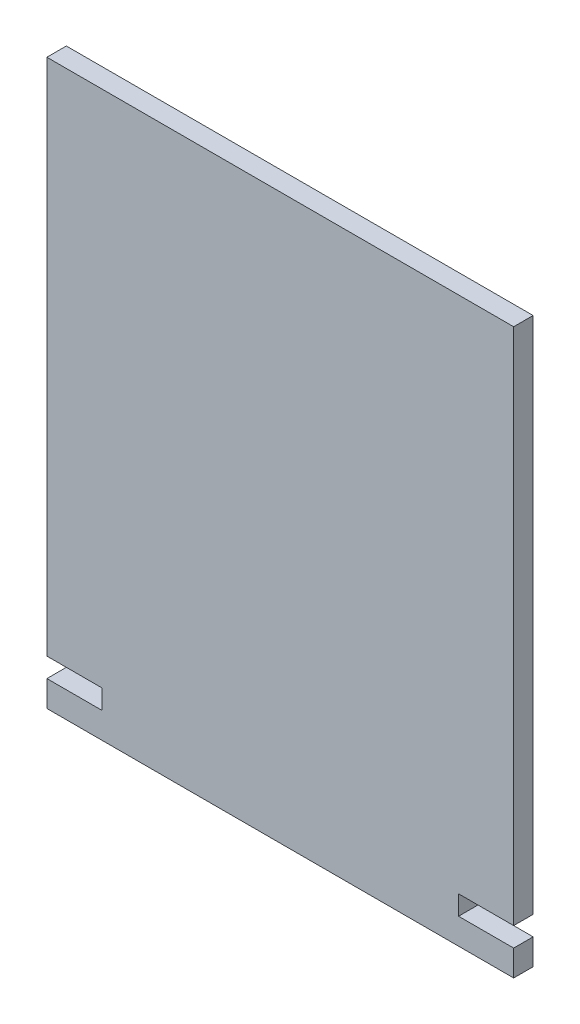
ISO-10303-21;
HEADER;
FILE_DESCRIPTION(('STEP AP214'),'2;1');
FILE_NAME('part.step','',(''),(''),'','','');
FILE_SCHEMA(('AUTOMOTIVE_DESIGN { 1 0 10303 214 1 1 1 1 }'));
ENDSEC;
DATA;
#1=APPLICATION_CONTEXT('core data for automotive mechanical design processes');
#2=APPLICATION_PROTOCOL_DEFINITION('international standard','automotive_design',2000,#1);
#3=PRODUCT_CONTEXT('',#1,'mechanical');
#4=PRODUCT('Part','Part','',(#3));
#5=PRODUCT_RELATED_PRODUCT_CATEGORY('part','',(#4));
#6=PRODUCT_DEFINITION_FORMATION('','',#4);
#7=PRODUCT_DEFINITION_CONTEXT('part definition',#1,'design');
#8=PRODUCT_DEFINITION('design','',#6,#7);
#9=PRODUCT_DEFINITION_SHAPE('','',#8);
#10=(LENGTH_UNIT() NAMED_UNIT(*) SI_UNIT(.MILLI.,.METRE.));
#11=(NAMED_UNIT(*) PLANE_ANGLE_UNIT() SI_UNIT($,.RADIAN.));
#12=(NAMED_UNIT(*) SI_UNIT($,.STERADIAN.) SOLID_ANGLE_UNIT());
#13=UNCERTAINTY_MEASURE_WITH_UNIT(LENGTH_MEASURE(1.E-05),#10,'distance_accuracy_value','');
#14=(GEOMETRIC_REPRESENTATION_CONTEXT(3) GLOBAL_UNCERTAINTY_ASSIGNED_CONTEXT((#13)) GLOBAL_UNIT_ASSIGNED_CONTEXT((#10,
#11,#12)) REPRESENTATION_CONTEXT('',''));
#15=CARTESIAN_POINT('',(0.,0.,0.));
#16=DIRECTION('',(0.,0.,1.));
#17=DIRECTION('',(1.,0.,0.));
#18=AXIS2_PLACEMENT_3D('',#15,#16,#17);
#19=CARTESIAN_POINT('',(36.,-17.5283018867924,3.));
#20=DIRECTION('',(0.,-1.,0.));
#21=DIRECTION('',(0.,0.,-1.));
#22=AXIS2_PLACEMENT_3D('',#19,#20,#21);
#23=PLANE('',#22);
#24=DIRECTION('',(-1.,0.,0.));
#25=VECTOR('',#24,1.);
#26=CARTESIAN_POINT('',(36.,-17.5283018867924,0.));
#27=LINE('',#26,#25);
#28=CARTESIAN_POINT('',(36.,-17.5283018867924,0.));
#29=VERTEX_POINT('',#28);
#30=CARTESIAN_POINT('',(27.5,-17.5283018867924,0.));
#31=VERTEX_POINT('',#30);
#32=EDGE_CURVE('E154',#29,#31,#27,.T.);
#33=ORIENTED_EDGE('',*,*,#32,.T.);
#34=DIRECTION('',(0.,0.,-1.));
#35=VECTOR('',#34,1.);
#36=CARTESIAN_POINT('',(27.5,-17.5283018867924,3.));
#37=LINE('',#36,#35);
#38=CARTESIAN_POINT('',(27.5,-17.5283018867924,3.));
#39=VERTEX_POINT('',#38);
#40=EDGE_CURVE('E11',#39,#31,#37,.T.);
#41=ORIENTED_EDGE('',*,*,#40,.F.);
#42=DIRECTION('',(-1.,0.,0.));
#43=VECTOR('',#42,1.);
#44=CARTESIAN_POINT('',(36.,-17.5283018867924,3.));
#45=LINE('',#44,#43);
#46=CARTESIAN_POINT('',(36.,-17.5283018867924,3.));
#47=VERTEX_POINT('',#46);
#48=EDGE_CURVE('E176',#47,#39,#45,.T.);
#49=ORIENTED_EDGE('',*,*,#48,.F.);
#50=DIRECTION('',(0.,0.,-1.));
#51=VECTOR('',#50,1.);
#52=CARTESIAN_POINT('',(36.,-17.5283018867924,3.));
#53=LINE('',#52,#51);
#54=EDGE_CURVE('E150',#47,#29,#53,.T.);
#55=ORIENTED_EDGE('',*,*,#54,.T.);
#56=EDGE_LOOP('',(#33,#41,#49,#55));
#57=FACE_BOUND('',#56,.T.);
#58=ADVANCED_FACE('F34',(#57),#23,.F.);
#59=CARTESIAN_POINT('',(27.5,-17.5283018867924,3.));
#60=DIRECTION('',(-1.,0.,0.));
#61=DIRECTION('',(0.,0.,1.));
#62=AXIS2_PLACEMENT_3D('',#59,#60,#61);
#63=PLANE('',#62);
#64=DIRECTION('',(0.,1.,0.));
#65=VECTOR('',#64,1.);
#66=CARTESIAN_POINT('',(27.5,-17.5283018867924,0.));
#67=LINE('',#66,#65);
#68=CARTESIAN_POINT('',(27.5,-14.5283018867924,0.));
#69=VERTEX_POINT('',#68);
#70=EDGE_CURVE('E157',#31,#69,#67,.T.);
#71=ORIENTED_EDGE('',*,*,#70,.T.);
#72=DIRECTION('',(0.,0.,-1.));
#73=VECTOR('',#72,1.);
#74=CARTESIAN_POINT('',(27.5,-14.5283018867924,3.));
#75=LINE('',#74,#73);
#76=CARTESIAN_POINT('',(27.5,-14.5283018867924,3.));
#77=VERTEX_POINT('',#76);
#78=EDGE_CURVE('E42',#77,#69,#75,.T.);
#79=ORIENTED_EDGE('',*,*,#78,.F.);
#80=DIRECTION('',(0.,1.,0.));
#81=VECTOR('',#80,1.);
#82=CARTESIAN_POINT('',(27.5,-17.5283018867924,3.));
#83=LINE('',#82,#81);
#84=EDGE_CURVE('E105',#39,#77,#83,.T.);
#85=ORIENTED_EDGE('',*,*,#84,.F.);
#86=ORIENTED_EDGE('',*,*,#40,.T.);
#87=EDGE_LOOP('',(#71,#79,#85,#86));
#88=FACE_BOUND('',#87,.T.);
#89=ADVANCED_FACE('F254',(#88),#63,.F.);
#90=CARTESIAN_POINT('',(27.5,-14.5283018867924,3.));
#91=DIRECTION('',(0.,1.,0.));
#92=DIRECTION('',(-1.,0.,0.));
#93=AXIS2_PLACEMENT_3D('',#90,#91,#92);
#94=PLANE('',#93);
#95=DIRECTION('',(1.,0.,0.));
#96=VECTOR('',#95,1.);
#97=CARTESIAN_POINT('',(27.5,-14.5283018867924,0.));
#98=LINE('',#97,#96);
#99=CARTESIAN_POINT('',(36.,-14.5283018867924,0.));
#100=VERTEX_POINT('',#99);
#101=EDGE_CURVE('E159',#69,#100,#98,.T.);
#102=ORIENTED_EDGE('',*,*,#101,.T.);
#103=DIRECTION('',(0.,0.,-1.));
#104=VECTOR('',#103,1.);
#105=CARTESIAN_POINT('',(36.,-14.5283018867924,3.));
#106=LINE('',#105,#104);
#107=CARTESIAN_POINT('',(36.,-14.5283018867924,3.));
#108=VERTEX_POINT('',#107);
#109=EDGE_CURVE('E195',#108,#100,#106,.T.);
#110=ORIENTED_EDGE('',*,*,#109,.F.);
#111=DIRECTION('',(1.,0.,0.));
#112=VECTOR('',#111,1.);
#113=CARTESIAN_POINT('',(27.5,-14.5283018867924,3.));
#114=LINE('',#113,#112);
#115=EDGE_CURVE('E203',#77,#108,#114,.T.);
#116=ORIENTED_EDGE('',*,*,#115,.F.);
#117=ORIENTED_EDGE('',*,*,#78,.T.);
#118=EDGE_LOOP('',(#102,#110,#116,#117));
#119=FACE_BOUND('',#118,.T.);
#120=ADVANCED_FACE('F201',(#119),#94,.F.);
#121=CARTESIAN_POINT('',(36.,-14.5283018867924,3.));
#122=DIRECTION('',(-1.,0.,0.));
#123=DIRECTION('',(0.,-1.,0.));
#124=AXIS2_PLACEMENT_3D('',#121,#122,#123);
#125=PLANE('',#124);
#126=DIRECTION('',(0.,1.,0.));
#127=VECTOR('',#126,1.);
#128=CARTESIAN_POINT('',(36.,-14.5283018867924,0.));
#129=LINE('',#128,#127);
#130=CARTESIAN_POINT('',(36.,65.4716981132076,0.));
#131=VERTEX_POINT('',#130);
#132=EDGE_CURVE('E161',#100,#131,#129,.T.);
#133=ORIENTED_EDGE('',*,*,#132,.T.);
#134=DIRECTION('',(0.,0.,-1.));
#135=VECTOR('',#134,1.);
#136=CARTESIAN_POINT('',(36.,65.4716981132076,3.));
#137=LINE('',#136,#135);
#138=CARTESIAN_POINT('',(36.,65.4716981132076,3.));
#139=VERTEX_POINT('',#138);
#140=EDGE_CURVE('E192',#139,#131,#137,.T.);
#141=ORIENTED_EDGE('',*,*,#140,.F.);
#142=DIRECTION('',(0.,1.,0.));
#143=VECTOR('',#142,1.);
#144=CARTESIAN_POINT('',(36.,-14.5283018867924,3.));
#145=LINE('',#144,#143);
#146=EDGE_CURVE('E221',#108,#139,#145,.T.);
#147=ORIENTED_EDGE('',*,*,#146,.F.);
#148=ORIENTED_EDGE('',*,*,#109,.T.);
#149=EDGE_LOOP('',(#133,#141,#147,#148));
#150=FACE_BOUND('',#149,.T.);
#151=ADVANCED_FACE('F212',(#150),#125,.F.);
#152=CARTESIAN_POINT('',(-36.,65.4716981132076,3.));
#153=DIRECTION('',(0.,-1.,0.));
#154=DIRECTION('',(0.,0.,-1.));
#155=AXIS2_PLACEMENT_3D('',#152,#153,#154);
#156=PLANE('',#155);
#157=DIRECTION('',(-1.,0.,0.));
#158=VECTOR('',#157,1.);
#159=CARTESIAN_POINT('',(-36.,65.4716981132076,0.));
#160=LINE('',#159,#158);
#161=CARTESIAN_POINT('',(-36.,65.4716981132076,0.));
#162=VERTEX_POINT('',#161);
#163=EDGE_CURVE('E163',#131,#162,#160,.T.);
#164=ORIENTED_EDGE('',*,*,#163,.T.);
#165=DIRECTION('',(0.,0.,-1.));
#166=VECTOR('',#165,1.);
#167=CARTESIAN_POINT('',(-36.,65.4716981132076,3.));
#168=LINE('',#167,#166);
#169=CARTESIAN_POINT('',(-36.,65.4716981132076,3.));
#170=VERTEX_POINT('',#169);
#171=EDGE_CURVE('E189',#170,#162,#168,.T.);
#172=ORIENTED_EDGE('',*,*,#171,.F.);
#173=DIRECTION('',(-1.,0.,0.));
#174=VECTOR('',#173,1.);
#175=CARTESIAN_POINT('',(-36.,65.4716981132076,3.));
#176=LINE('',#175,#174);
#177=EDGE_CURVE('E218',#139,#170,#176,.T.);
#178=ORIENTED_EDGE('',*,*,#177,.F.);
#179=ORIENTED_EDGE('',*,*,#140,.T.);
#180=EDGE_LOOP('',(#164,#172,#178,#179));
#181=FACE_BOUND('',#180,.T.);
#182=ADVANCED_FACE('F216',(#181),#156,.F.);
#183=CARTESIAN_POINT('',(-36.,-14.5283018867924,3.));
#184=DIRECTION('',(1.,0.,0.));
#185=DIRECTION('',(0.,1.,0.));
#186=AXIS2_PLACEMENT_3D('',#183,#184,#185);
#187=PLANE('',#186);
#188=DIRECTION('',(0.,-1.,0.));
#189=VECTOR('',#188,1.);
#190=CARTESIAN_POINT('',(-36.,-14.5283018867924,0.));
#191=LINE('',#190,#189);
#192=CARTESIAN_POINT('',(-36.,-14.5283018867924,0.));
#193=VERTEX_POINT('',#192);
#194=EDGE_CURVE('E165',#162,#193,#191,.T.);
#195=ORIENTED_EDGE('',*,*,#194,.T.);
#196=DIRECTION('',(0.,0.,-1.));
#197=VECTOR('',#196,1.);
#198=CARTESIAN_POINT('',(-36.,-14.5283018867924,3.));
#199=LINE('',#198,#197);
#200=CARTESIAN_POINT('',(-36.,-14.5283018867924,3.));
#201=VERTEX_POINT('',#200);
#202=EDGE_CURVE('E186',#201,#193,#199,.T.);
#203=ORIENTED_EDGE('',*,*,#202,.F.);
#204=DIRECTION('',(0.,-1.,0.));
#205=VECTOR('',#204,1.);
#206=CARTESIAN_POINT('',(-36.,-14.5283018867924,3.));
#207=LINE('',#206,#205);
#208=EDGE_CURVE('E220',#170,#201,#207,.T.);
#209=ORIENTED_EDGE('',*,*,#208,.F.);
#210=ORIENTED_EDGE('',*,*,#171,.T.);
#211=EDGE_LOOP('',(#195,#203,#209,#210));
#212=FACE_BOUND('',#211,.T.);
#213=ADVANCED_FACE('F267',(#212),#187,.F.);
#214=CARTESIAN_POINT('',(-27.5,-14.5283018867924,3.));
#215=DIRECTION('',(0.,1.,0.));
#216=DIRECTION('',(-1.,0.,0.));
#217=AXIS2_PLACEMENT_3D('',#214,#215,#216);
#218=PLANE('',#217);
#219=DIRECTION('',(1.,0.,0.));
#220=VECTOR('',#219,1.);
#221=CARTESIAN_POINT('',(-27.5,-14.5283018867924,0.));
#222=LINE('',#221,#220);
#223=CARTESIAN_POINT('',(-27.5,-14.5283018867924,0.));
#224=VERTEX_POINT('',#223);
#225=EDGE_CURVE('E167',#193,#224,#222,.T.);
#226=ORIENTED_EDGE('',*,*,#225,.T.);
#227=DIRECTION('',(0.,0.,-1.));
#228=VECTOR('',#227,1.);
#229=CARTESIAN_POINT('',(-27.5,-14.5283018867924,3.));
#230=LINE('',#229,#228);
#231=CARTESIAN_POINT('',(-27.5,-14.5283018867924,3.));
#232=VERTEX_POINT('',#231);
#233=EDGE_CURVE('E183',#232,#224,#230,.T.);
#234=ORIENTED_EDGE('',*,*,#233,.F.);
#235=DIRECTION('',(1.,0.,0.));
#236=VECTOR('',#235,1.);
#237=CARTESIAN_POINT('',(-27.5,-14.5283018867924,3.));
#238=LINE('',#237,#236);
#239=EDGE_CURVE('E223',#201,#232,#238,.T.);
#240=ORIENTED_EDGE('',*,*,#239,.F.);
#241=ORIENTED_EDGE('',*,*,#202,.T.);
#242=EDGE_LOOP('',(#226,#234,#240,#241));
#243=FACE_BOUND('',#242,.T.);
#244=ADVANCED_FACE('F270',(#243),#218,.F.);
#245=CARTESIAN_POINT('',(-27.5,-17.5283018867924,3.));
#246=DIRECTION('',(1.,0.,0.));
#247=DIRECTION('',(0.,0.,-1.));
#248=AXIS2_PLACEMENT_3D('',#245,#246,#247);
#249=PLANE('',#248);
#250=DIRECTION('',(0.,-1.,0.));
#251=VECTOR('',#250,1.);
#252=CARTESIAN_POINT('',(-27.5,-17.5283018867924,0.));
#253=LINE('',#252,#251);
#254=CARTESIAN_POINT('',(-27.5,-17.5283018867924,0.));
#255=VERTEX_POINT('',#254);
#256=EDGE_CURVE('E169',#224,#255,#253,.T.);
#257=ORIENTED_EDGE('',*,*,#256,.T.);
#258=DIRECTION('',(0.,0.,-1.));
#259=VECTOR('',#258,1.);
#260=CARTESIAN_POINT('',(-27.5,-17.5283018867924,3.));
#261=LINE('',#260,#259);
#262=CARTESIAN_POINT('',(-27.5,-17.5283018867924,3.));
#263=VERTEX_POINT('',#262);
#264=EDGE_CURVE('E180',#263,#255,#261,.T.);
#265=ORIENTED_EDGE('',*,*,#264,.F.);
#266=DIRECTION('',(0.,-1.,0.));
#267=VECTOR('',#266,1.);
#268=CARTESIAN_POINT('',(-27.5,-17.5283018867924,3.));
#269=LINE('',#268,#267);
#270=EDGE_CURVE('E229',#232,#263,#269,.T.);
#271=ORIENTED_EDGE('',*,*,#270,.F.);
#272=ORIENTED_EDGE('',*,*,#233,.T.);
#273=EDGE_LOOP('',(#257,#265,#271,#272));
#274=FACE_BOUND('',#273,.T.);
#275=ADVANCED_FACE('F235',(#274),#249,.F.);
#276=CARTESIAN_POINT('',(-36.,-17.5283018867924,3.));
#277=DIRECTION('',(0.,-1.,0.));
#278=DIRECTION('',(1.,0.,0.));
#279=AXIS2_PLACEMENT_3D('',#276,#277,#278);
#280=PLANE('',#279);
#281=DIRECTION('',(-1.,0.,0.));
#282=VECTOR('',#281,1.);
#283=CARTESIAN_POINT('',(-36.,-17.5283018867924,0.));
#284=LINE('',#283,#282);
#285=CARTESIAN_POINT('',(-36.,-17.5283018867924,0.));
#286=VERTEX_POINT('',#285);
#287=EDGE_CURVE('E171',#255,#286,#284,.T.);
#288=ORIENTED_EDGE('',*,*,#287,.T.);
#289=DIRECTION('',(0.,0.,-1.));
#290=VECTOR('',#289,1.);
#291=CARTESIAN_POINT('',(-36.,-17.5283018867924,3.));
#292=LINE('',#291,#290);
#293=CARTESIAN_POINT('',(-36.,-17.5283018867924,3.));
#294=VERTEX_POINT('',#293);
#295=EDGE_CURVE('E145',#294,#286,#292,.T.);
#296=ORIENTED_EDGE('',*,*,#295,.F.);
#297=DIRECTION('',(-1.,0.,0.));
#298=VECTOR('',#297,1.);
#299=CARTESIAN_POINT('',(-36.,-17.5283018867924,3.));
#300=LINE('',#299,#298);
#301=EDGE_CURVE('E136',#263,#294,#300,.T.);
#302=ORIENTED_EDGE('',*,*,#301,.F.);
#303=ORIENTED_EDGE('',*,*,#264,.T.);
#304=EDGE_LOOP('',(#288,#296,#302,#303));
#305=FACE_BOUND('',#304,.T.);
#306=ADVANCED_FACE('F239',(#305),#280,.F.);
#307=CARTESIAN_POINT('',(-36.,-21.5283018867924,3.));
#308=DIRECTION('',(1.,0.,0.));
#309=DIRECTION('',(0.,1.,0.));
#310=AXIS2_PLACEMENT_3D('',#307,#308,#309);
#311=PLANE('',#310);
#312=DIRECTION('',(0.,-1.,0.));
#313=VECTOR('',#312,1.);
#314=CARTESIAN_POINT('',(-36.,-21.5283018867924,0.));
#315=LINE('',#314,#313);
#316=CARTESIAN_POINT('',(-36.,-21.5283018867924,0.));
#317=VERTEX_POINT('',#316);
#318=EDGE_CURVE('E144',#286,#317,#315,.T.);
#319=ORIENTED_EDGE('',*,*,#318,.T.);
#320=DIRECTION('',(0.,0.,-1.));
#321=VECTOR('',#320,1.);
#322=CARTESIAN_POINT('',(-36.,-21.5283018867924,3.));
#323=LINE('',#322,#321);
#324=CARTESIAN_POINT('',(-36.,-21.5283018867924,3.));
#325=VERTEX_POINT('',#324);
#326=EDGE_CURVE('E141',#325,#317,#323,.T.);
#327=ORIENTED_EDGE('',*,*,#326,.F.);
#328=DIRECTION('',(0.,-1.,0.));
#329=VECTOR('',#328,1.);
#330=CARTESIAN_POINT('',(-36.,-21.5283018867924,3.));
#331=LINE('',#330,#329);
#332=EDGE_CURVE('E130',#294,#325,#331,.T.);
#333=ORIENTED_EDGE('',*,*,#332,.F.);
#334=ORIENTED_EDGE('',*,*,#295,.T.);
#335=EDGE_LOOP('',(#319,#327,#333,#334));
#336=FACE_BOUND('',#335,.T.);
#337=ADVANCED_FACE('F142',(#336),#311,.F.);
#338=CARTESIAN_POINT('',(36.,-21.5283018867924,3.));
#339=DIRECTION('',(0.,1.,0.));
#340=DIRECTION('',(-1.,0.,0.));
#341=AXIS2_PLACEMENT_3D('',#338,#339,#340);
#342=PLANE('',#341);
#343=DIRECTION('',(1.,0.,0.));
#344=VECTOR('',#343,1.);
#345=CARTESIAN_POINT('',(36.,-21.5283018867924,0.));
#346=LINE('',#345,#344);
#347=CARTESIAN_POINT('',(36.,-21.5283018867924,0.));
#348=VERTEX_POINT('',#347);
#349=EDGE_CURVE('E91',#317,#348,#346,.T.);
#350=ORIENTED_EDGE('',*,*,#349,.T.);
#351=DIRECTION('',(0.,0.,-1.));
#352=VECTOR('',#351,1.);
#353=CARTESIAN_POINT('',(36.,-21.5283018867924,3.));
#354=LINE('',#353,#352);
#355=CARTESIAN_POINT('',(36.,-21.5283018867924,3.));
#356=VERTEX_POINT('',#355);
#357=EDGE_CURVE('E146',#356,#348,#354,.T.);
#358=ORIENTED_EDGE('',*,*,#357,.F.);
#359=DIRECTION('',(1.,0.,0.));
#360=VECTOR('',#359,1.);
#361=CARTESIAN_POINT('',(36.,-21.5283018867924,3.));
#362=LINE('',#361,#360);
#363=EDGE_CURVE('E134',#325,#356,#362,.T.);
#364=ORIENTED_EDGE('',*,*,#363,.F.);
#365=ORIENTED_EDGE('',*,*,#326,.T.);
#366=EDGE_LOOP('',(#350,#358,#364,#365));
#367=FACE_BOUND('',#366,.T.);
#368=ADVANCED_FACE('F148',(#367),#342,.F.);
#369=CARTESIAN_POINT('',(36.,-21.5283018867924,3.));
#370=DIRECTION('',(-1.,0.,0.));
#371=DIRECTION('',(0.,-1.,0.));
#372=AXIS2_PLACEMENT_3D('',#369,#370,#371);
#373=PLANE('',#372);
#374=DIRECTION('',(0.,1.,0.));
#375=VECTOR('',#374,1.);
#376=CARTESIAN_POINT('',(36.,-21.5283018867924,0.));
#377=LINE('',#376,#375);
#378=EDGE_CURVE('E97',#348,#29,#377,.T.);
#379=ORIENTED_EDGE('',*,*,#378,.T.);
#380=ORIENTED_EDGE('',*,*,#54,.F.);
#381=DIRECTION('',(0.,1.,0.));
#382=VECTOR('',#381,1.);
#383=CARTESIAN_POINT('',(36.,-21.5283018867924,3.));
#384=LINE('',#383,#382);
#385=EDGE_CURVE('E50',#356,#47,#384,.T.);
#386=ORIENTED_EDGE('',*,*,#385,.F.);
#387=ORIENTED_EDGE('',*,*,#357,.T.);
#388=EDGE_LOOP('',(#379,#380,#386,#387));
#389=FACE_BOUND('',#388,.T.);
#390=ADVANCED_FACE('F243',(#389),#373,.F.);
#391=CARTESIAN_POINT('',(0.,0.,3.));
#392=DIRECTION('',(0.,0.,-1.));
#393=DIRECTION('',(-1.,0.,0.));
#394=AXIS2_PLACEMENT_3D('',#391,#392,#393);
#395=PLANE('',#394);
#396=ORIENTED_EDGE('',*,*,#48,.T.);
#397=ORIENTED_EDGE('',*,*,#84,.T.);
#398=ORIENTED_EDGE('',*,*,#115,.T.);
#399=ORIENTED_EDGE('',*,*,#146,.T.);
#400=ORIENTED_EDGE('',*,*,#177,.T.);
#401=ORIENTED_EDGE('',*,*,#208,.T.);
#402=ORIENTED_EDGE('',*,*,#239,.T.);
#403=ORIENTED_EDGE('',*,*,#270,.T.);
#404=ORIENTED_EDGE('',*,*,#301,.T.);
#405=ORIENTED_EDGE('',*,*,#332,.T.);
#406=ORIENTED_EDGE('',*,*,#363,.T.);
#407=ORIENTED_EDGE('',*,*,#385,.T.);
#408=EDGE_LOOP('',(#396,#397,#398,#399,#400,#401,#402,#403,#404,#405,#406,#407));
#409=FACE_BOUND('',#408,.T.);
#410=ADVANCED_FACE('F132',(#409),#395,.F.);
#411=CARTESIAN_POINT('',(0.,0.,0.));
#412=DIRECTION('',(0.,0.,-1.));
#413=DIRECTION('',(-1.,0.,0.));
#414=AXIS2_PLACEMENT_3D('',#411,#412,#413);
#415=PLANE('',#414);
#416=ORIENTED_EDGE('',*,*,#32,.F.);
#417=ORIENTED_EDGE('',*,*,#378,.F.);
#418=ORIENTED_EDGE('',*,*,#349,.F.);
#419=ORIENTED_EDGE('',*,*,#318,.F.);
#420=ORIENTED_EDGE('',*,*,#287,.F.);
#421=ORIENTED_EDGE('',*,*,#256,.F.);
#422=ORIENTED_EDGE('',*,*,#225,.F.);
#423=ORIENTED_EDGE('',*,*,#194,.F.);
#424=ORIENTED_EDGE('',*,*,#163,.F.);
#425=ORIENTED_EDGE('',*,*,#132,.F.);
#426=ORIENTED_EDGE('',*,*,#101,.F.);
#427=ORIENTED_EDGE('',*,*,#70,.F.);
#428=EDGE_LOOP('',(#416,#417,#418,#419,#420,#421,#422,#423,#424,#425,#426,#427));
#429=FACE_BOUND('',#428,.T.);
#430=ADVANCED_FACE('F207',(#429),#415,.T.);
#431=CLOSED_SHELL('',(#58,#89,#120,#151,#182,#213,#244,#275,#306,#337,#368,#390,#410,#430));
#432=MANIFOLD_SOLID_BREP('B2',#431);
#433=ADVANCED_BREP_SHAPE_REPRESENTATION('',(#18,#432),#14);
#434=SHAPE_DEFINITION_REPRESENTATION(#9,#433);
ENDSEC;
END-ISO-10303-21;
